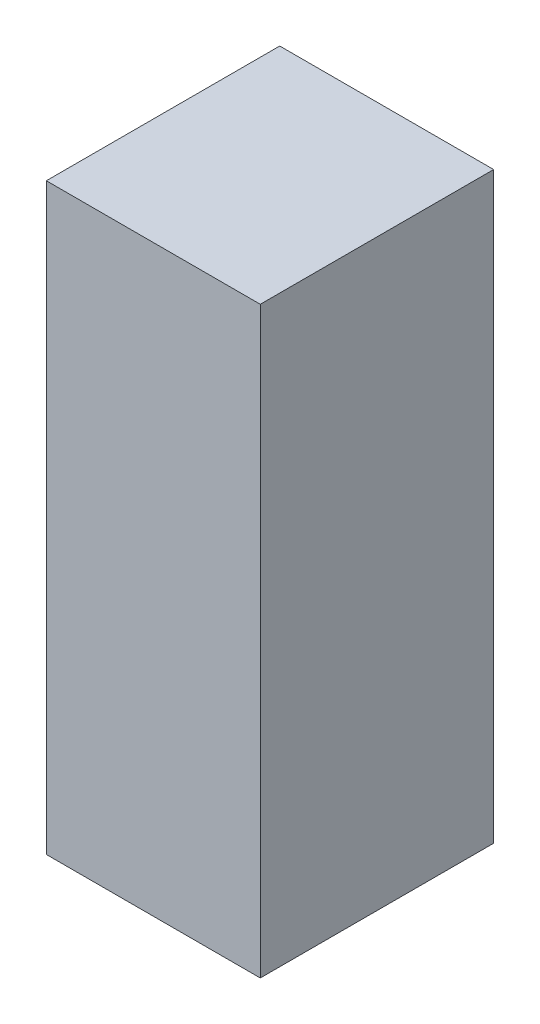
ISO-10303-21;
HEADER;
FILE_DESCRIPTION(('STEP AP214'),'2;1');
FILE_NAME('part.step','',(''),(''),'','','');
FILE_SCHEMA(('AUTOMOTIVE_DESIGN { 1 0 10303 214 1 1 1 1 }'));
ENDSEC;
DATA;
#1=APPLICATION_CONTEXT('core data for automotive mechanical design processes');
#2=APPLICATION_PROTOCOL_DEFINITION('international standard','automotive_design',2000,#1);
#3=PRODUCT_CONTEXT('',#1,'mechanical');
#4=PRODUCT('Part','Part','',(#3));
#5=PRODUCT_RELATED_PRODUCT_CATEGORY('part','',(#4));
#6=PRODUCT_DEFINITION_FORMATION('','',#4);
#7=PRODUCT_DEFINITION_CONTEXT('part definition',#1,'design');
#8=PRODUCT_DEFINITION('design','',#6,#7);
#9=PRODUCT_DEFINITION_SHAPE('','',#8);
#10=(LENGTH_UNIT() NAMED_UNIT(*) SI_UNIT(.MILLI.,.METRE.));
#11=(NAMED_UNIT(*) PLANE_ANGLE_UNIT() SI_UNIT($,.RADIAN.));
#12=(NAMED_UNIT(*) SI_UNIT($,.STERADIAN.) SOLID_ANGLE_UNIT());
#13=UNCERTAINTY_MEASURE_WITH_UNIT(LENGTH_MEASURE(1.E-05),#10,'distance_accuracy_value','');
#14=(GEOMETRIC_REPRESENTATION_CONTEXT(3) GLOBAL_UNCERTAINTY_ASSIGNED_CONTEXT((#13)) GLOBAL_UNIT_ASSIGNED_CONTEXT((#10,
#11,#12)) REPRESENTATION_CONTEXT('',''));
#15=CARTESIAN_POINT('',(0.,0.,0.));
#16=DIRECTION('',(0.,0.,1.));
#17=DIRECTION('',(1.,0.,0.));
#18=AXIS2_PLACEMENT_3D('',#15,#16,#17);
#19=CARTESIAN_POINT('',(-279.4,1524.,304.8));
#20=DIRECTION('',(1.,0.,0.));
#21=DIRECTION('',(0.,0.,-1.));
#22=AXIS2_PLACEMENT_3D('',#19,#20,#21);
#23=PLANE('',#22);
#24=DIRECTION('',(0.,0.,1.));
#25=VECTOR('',#24,1.);
#26=CARTESIAN_POINT('',(-279.4,0.,304.8));
#27=LINE('',#26,#25);
#28=CARTESIAN_POINT('',(-279.4,0.,-304.8));
#29=VERTEX_POINT('',#28);
#30=CARTESIAN_POINT('',(-279.4,0.,304.8));
#31=VERTEX_POINT('',#30);
#32=EDGE_CURVE('E98',#29,#31,#27,.T.);
#33=ORIENTED_EDGE('',*,*,#32,.T.);
#34=DIRECTION('',(0.,-1.,0.));
#35=VECTOR('',#34,1.);
#36=CARTESIAN_POINT('',(-279.4,1524.,304.8));
#37=LINE('',#36,#35);
#38=CARTESIAN_POINT('',(-279.4,1524.,304.8));
#39=VERTEX_POINT('',#38);
#40=EDGE_CURVE('E11',#39,#31,#37,.T.);
#41=ORIENTED_EDGE('',*,*,#40,.F.);
#42=DIRECTION('',(0.,0.,1.));
#43=VECTOR('',#42,1.);
#44=CARTESIAN_POINT('',(-279.4,1524.,304.8));
#45=LINE('',#44,#43);
#46=CARTESIAN_POINT('',(-279.4,1524.,-304.8));
#47=VERTEX_POINT('',#46);
#48=EDGE_CURVE('E86',#47,#39,#45,.T.);
#49=ORIENTED_EDGE('',*,*,#48,.F.);
#50=DIRECTION('',(0.,-1.,0.));
#51=VECTOR('',#50,1.);
#52=CARTESIAN_POINT('',(-279.4,1524.,-304.8));
#53=LINE('',#52,#51);
#54=EDGE_CURVE('E94',#47,#29,#53,.T.);
#55=ORIENTED_EDGE('',*,*,#54,.T.);
#56=EDGE_LOOP('',(#33,#41,#49,#55));
#57=FACE_BOUND('',#56,.T.);
#58=ADVANCED_FACE('F35',(#57),#23,.F.);
#59=CARTESIAN_POINT('',(279.4,1524.,304.8));
#60=DIRECTION('',(0.,0.,-1.));
#61=DIRECTION('',(-1.,0.,0.));
#62=AXIS2_PLACEMENT_3D('',#59,#60,#61);
#63=PLANE('',#62);
#64=DIRECTION('',(1.,0.,0.));
#65=VECTOR('',#64,1.);
#66=CARTESIAN_POINT('',(279.4,0.,304.8));
#67=LINE('',#66,#65);
#68=CARTESIAN_POINT('',(279.4,0.,304.8));
#69=VERTEX_POINT('',#68);
#70=EDGE_CURVE('E90',#31,#69,#67,.T.);
#71=ORIENTED_EDGE('',*,*,#70,.T.);
#72=DIRECTION('',(0.,-1.,0.));
#73=VECTOR('',#72,1.);
#74=CARTESIAN_POINT('',(279.4,1524.,304.8));
#75=LINE('',#74,#73);
#76=CARTESIAN_POINT('',(279.4,1524.,304.8));
#77=VERTEX_POINT('',#76);
#78=EDGE_CURVE('E43',#77,#69,#75,.T.);
#79=ORIENTED_EDGE('',*,*,#78,.F.);
#80=DIRECTION('',(1.,0.,0.));
#81=VECTOR('',#80,1.);
#82=CARTESIAN_POINT('',(279.4,1524.,304.8));
#83=LINE('',#82,#81);
#84=EDGE_CURVE('E81',#39,#77,#83,.T.);
#85=ORIENTED_EDGE('',*,*,#84,.F.);
#86=ORIENTED_EDGE('',*,*,#40,.T.);
#87=EDGE_LOOP('',(#71,#79,#85,#86));
#88=FACE_BOUND('',#87,.T.);
#89=ADVANCED_FACE('F89',(#88),#63,.F.);
#90=CARTESIAN_POINT('',(279.4,1524.,304.8));
#91=DIRECTION('',(-1.,0.,0.));
#92=DIRECTION('',(0.,0.,1.));
#93=AXIS2_PLACEMENT_3D('',#90,#91,#92);
#94=PLANE('',#93);
#95=DIRECTION('',(0.,0.,-1.));
#96=VECTOR('',#95,1.);
#97=CARTESIAN_POINT('',(279.4,0.,304.8));
#98=LINE('',#97,#96);
#99=CARTESIAN_POINT('',(279.4,0.,-304.8));
#100=VERTEX_POINT('',#99);
#101=EDGE_CURVE('E68',#69,#100,#98,.T.);
#102=ORIENTED_EDGE('',*,*,#101,.T.);
#103=DIRECTION('',(0.,-1.,0.));
#104=VECTOR('',#103,1.);
#105=CARTESIAN_POINT('',(279.4,1524.,-304.8));
#106=LINE('',#105,#104);
#107=CARTESIAN_POINT('',(279.4,1524.,-304.8));
#108=VERTEX_POINT('',#107);
#109=EDGE_CURVE('E91',#108,#100,#106,.T.);
#110=ORIENTED_EDGE('',*,*,#109,.F.);
#111=DIRECTION('',(0.,0.,-1.));
#112=VECTOR('',#111,1.);
#113=CARTESIAN_POINT('',(279.4,1524.,304.8));
#114=LINE('',#113,#112);
#115=EDGE_CURVE('E84',#77,#108,#114,.T.);
#116=ORIENTED_EDGE('',*,*,#115,.F.);
#117=ORIENTED_EDGE('',*,*,#78,.T.);
#118=EDGE_LOOP('',(#102,#110,#116,#117));
#119=FACE_BOUND('',#118,.T.);
#120=ADVANCED_FACE('F92',(#119),#94,.F.);
#121=CARTESIAN_POINT('',(279.4,1524.,-304.8));
#122=DIRECTION('',(0.,0.,1.));
#123=DIRECTION('',(1.,0.,0.));
#124=AXIS2_PLACEMENT_3D('',#121,#122,#123);
#125=PLANE('',#124);
#126=DIRECTION('',(-1.,0.,0.));
#127=VECTOR('',#126,1.);
#128=CARTESIAN_POINT('',(279.4,0.,-304.8));
#129=LINE('',#128,#127);
#130=EDGE_CURVE('E74',#100,#29,#129,.T.);
#131=ORIENTED_EDGE('',*,*,#130,.T.);
#132=ORIENTED_EDGE('',*,*,#54,.F.);
#133=DIRECTION('',(-1.,0.,0.));
#134=VECTOR('',#133,1.);
#135=CARTESIAN_POINT('',(279.4,1524.,-304.8));
#136=LINE('',#135,#134);
#137=EDGE_CURVE('E51',#108,#47,#136,.T.);
#138=ORIENTED_EDGE('',*,*,#137,.F.);
#139=ORIENTED_EDGE('',*,*,#109,.T.);
#140=EDGE_LOOP('',(#131,#132,#138,#139));
#141=FACE_BOUND('',#140,.T.);
#142=ADVANCED_FACE('F105',(#141),#125,.F.);
#143=CARTESIAN_POINT('',(0.,1524.,0.));
#144=DIRECTION('',(0.,1.,0.));
#145=DIRECTION('',(0.,0.,1.));
#146=AXIS2_PLACEMENT_3D('',#143,#144,#145);
#147=PLANE('',#146);
#148=ORIENTED_EDGE('',*,*,#48,.T.);
#149=ORIENTED_EDGE('',*,*,#84,.T.);
#150=ORIENTED_EDGE('',*,*,#115,.T.);
#151=ORIENTED_EDGE('',*,*,#137,.T.);
#152=EDGE_LOOP('',(#148,#149,#150,#151));
#153=FACE_BOUND('',#152,.T.);
#154=ADVANCED_FACE('F82',(#153),#147,.T.);
#155=CARTESIAN_POINT('',(0.,0.,0.));
#156=DIRECTION('',(0.,1.,0.));
#157=DIRECTION('',(0.,0.,1.));
#158=AXIS2_PLACEMENT_3D('',#155,#156,#157);
#159=PLANE('',#158);
#160=ORIENTED_EDGE('',*,*,#32,.F.);
#161=ORIENTED_EDGE('',*,*,#130,.F.);
#162=ORIENTED_EDGE('',*,*,#101,.F.);
#163=ORIENTED_EDGE('',*,*,#70,.F.);
#164=EDGE_LOOP('',(#160,#161,#162,#163));
#165=FACE_BOUND('',#164,.T.);
#166=ADVANCED_FACE('F108',(#165),#159,.F.);
#167=CLOSED_SHELL('',(#58,#89,#120,#142,#154,#166));
#168=MANIFOLD_SOLID_BREP('B2',#167);
#169=ADVANCED_BREP_SHAPE_REPRESENTATION('',(#18,#168),#14);
#170=SHAPE_DEFINITION_REPRESENTATION(#9,#169);
ENDSEC;
END-ISO-10303-21;
